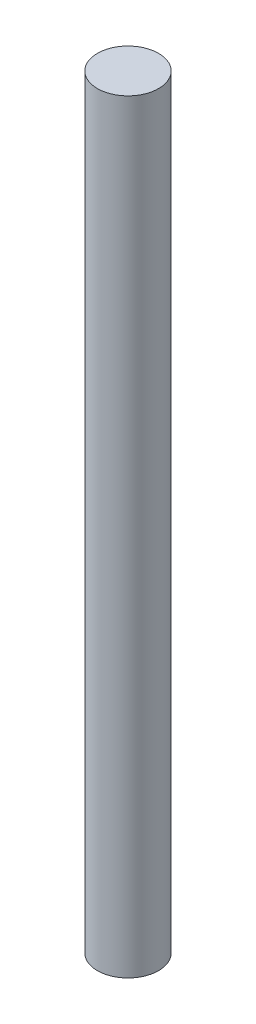
ISO-10303-21;
HEADER;
FILE_DESCRIPTION(('STEP AP214'),'2;1');
FILE_NAME('part.step','',(''),(''),'','','');
FILE_SCHEMA(('AUTOMOTIVE_DESIGN { 1 0 10303 214 1 1 1 1 }'));
ENDSEC;
DATA;
#1=APPLICATION_CONTEXT('core data for automotive mechanical design processes');
#2=APPLICATION_PROTOCOL_DEFINITION('international standard','automotive_design',2000,#1);
#3=PRODUCT_CONTEXT('',#1,'mechanical');
#4=PRODUCT('Part','Part','',(#3));
#5=PRODUCT_RELATED_PRODUCT_CATEGORY('part','',(#4));
#6=PRODUCT_DEFINITION_FORMATION('','',#4);
#7=PRODUCT_DEFINITION_CONTEXT('part definition',#1,'design');
#8=PRODUCT_DEFINITION('design','',#6,#7);
#9=PRODUCT_DEFINITION_SHAPE('','',#8);
#10=(LENGTH_UNIT() NAMED_UNIT(*) SI_UNIT(.MILLI.,.METRE.));
#11=(NAMED_UNIT(*) PLANE_ANGLE_UNIT() SI_UNIT($,.RADIAN.));
#12=(NAMED_UNIT(*) SI_UNIT($,.STERADIAN.) SOLID_ANGLE_UNIT());
#13=UNCERTAINTY_MEASURE_WITH_UNIT(LENGTH_MEASURE(1.E-05),#10,'distance_accuracy_value','');
#14=(GEOMETRIC_REPRESENTATION_CONTEXT(3) GLOBAL_UNCERTAINTY_ASSIGNED_CONTEXT((#13)) GLOBAL_UNIT_ASSIGNED_CONTEXT((#10,
#11,#12)) REPRESENTATION_CONTEXT('',''));
#15=CARTESIAN_POINT('',(0.,0.,0.));
#16=DIRECTION('',(0.,0.,1.));
#17=DIRECTION('',(1.,0.,0.));
#18=AXIS2_PLACEMENT_3D('',#15,#16,#17);
#19=CARTESIAN_POINT('',(0.,100.,0.));
#20=DIRECTION('',(0.,-1.,0.));
#21=DIRECTION('',(0.,0.,-1.));
#22=AXIS2_PLACEMENT_3D('',#19,#20,#21);
#23=CYLINDRICAL_SURFACE('',#22,4.);
#24=CARTESIAN_POINT('',(0.,100.,0.));
#25=DIRECTION('',(0.,1.,0.));
#26=DIRECTION('',(0.,0.,1.));
#27=AXIS2_PLACEMENT_3D('',#24,#25,#26);
#28=CIRCLE('',#27,4.);
#29=CARTESIAN_POINT('',(0.,100.,4.));
#30=VERTEX_POINT('',#29);
#31=EDGE_CURVE('E10',#30,#30,#28,.T.);
#32=ORIENTED_EDGE('',*,*,#31,.F.);
#33=EDGE_LOOP('',(#32));
#34=FACE_BOUND('',#33,.T.);
#35=CARTESIAN_POINT('',(0.,0.,0.));
#36=DIRECTION('',(0.,1.,0.));
#37=DIRECTION('',(0.,0.,1.));
#38=AXIS2_PLACEMENT_3D('',#35,#36,#37);
#39=CIRCLE('',#38,4.);
#40=CARTESIAN_POINT('',(0.,0.,4.));
#41=VERTEX_POINT('',#40);
#42=EDGE_CURVE('E40',#41,#41,#39,.T.);
#43=ORIENTED_EDGE('',*,*,#42,.T.);
#44=EDGE_LOOP('',(#43));
#45=FACE_BOUND('',#44,.T.);
#46=ADVANCED_FACE('F37',(#34,#45),#23,.T.);
#47=CARTESIAN_POINT('',(0.,100.,0.));
#48=DIRECTION('',(0.,1.,0.));
#49=DIRECTION('',(0.,0.,1.));
#50=AXIS2_PLACEMENT_3D('',#47,#48,#49);
#51=PLANE('',#50);
#52=ORIENTED_EDGE('',*,*,#31,.T.);
#53=EDGE_LOOP('',(#52));
#54=FACE_BOUND('',#53,.T.);
#55=ADVANCED_FACE('F54',(#54),#51,.T.);
#56=CARTESIAN_POINT('',(0.,0.,0.));
#57=DIRECTION('',(0.,1.,0.));
#58=DIRECTION('',(0.,0.,1.));
#59=AXIS2_PLACEMENT_3D('',#56,#57,#58);
#60=PLANE('',#59);
#61=ORIENTED_EDGE('',*,*,#42,.F.);
#62=EDGE_LOOP('',(#61));
#63=FACE_BOUND('',#62,.T.);
#64=ADVANCED_FACE('F52',(#63),#60,.F.);
#65=CLOSED_SHELL('',(#46,#55,#64));
#66=MANIFOLD_SOLID_BREP('B2',#65);
#67=ADVANCED_BREP_SHAPE_REPRESENTATION('',(#18,#66),#14);
#68=SHAPE_DEFINITION_REPRESENTATION(#9,#67);
ENDSEC;
END-ISO-10303-21;
